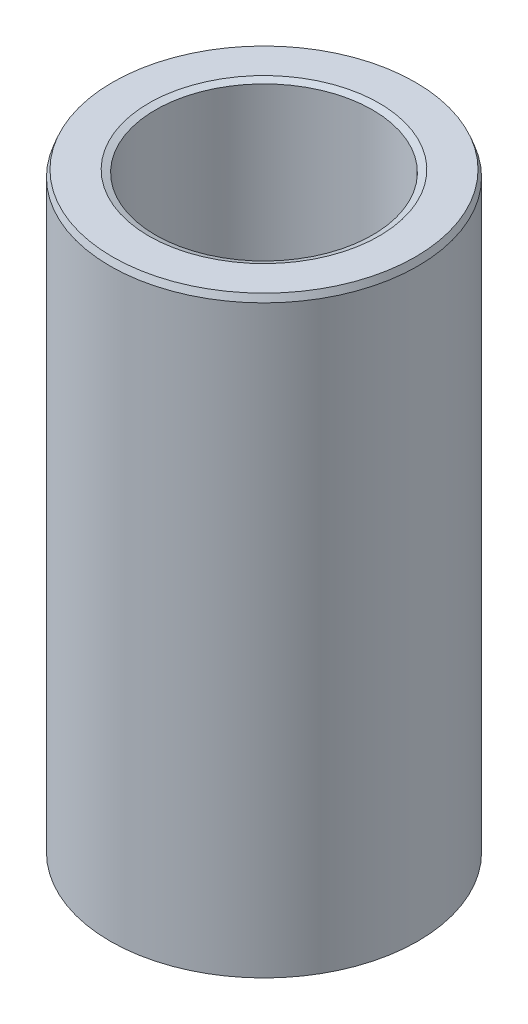
ISO-10303-21;
HEADER;
FILE_DESCRIPTION(('STEP AP214'),'2;1');
FILE_NAME('part.step','',(''),(''),'','','');
FILE_SCHEMA(('AUTOMOTIVE_DESIGN { 1 0 10303 214 1 1 1 1 }'));
ENDSEC;
DATA;
#1=APPLICATION_CONTEXT('core data for automotive mechanical design processes');
#2=APPLICATION_PROTOCOL_DEFINITION('international standard','automotive_design',2000,#1);
#3=PRODUCT_CONTEXT('',#1,'mechanical');
#4=PRODUCT('Part','Part','',(#3));
#5=PRODUCT_RELATED_PRODUCT_CATEGORY('part','',(#4));
#6=PRODUCT_DEFINITION_FORMATION('','',#4);
#7=PRODUCT_DEFINITION_CONTEXT('part definition',#1,'design');
#8=PRODUCT_DEFINITION('design','',#6,#7);
#9=PRODUCT_DEFINITION_SHAPE('','',#8);
#10=(LENGTH_UNIT() NAMED_UNIT(*) SI_UNIT(.MILLI.,.METRE.));
#11=(NAMED_UNIT(*) PLANE_ANGLE_UNIT() SI_UNIT($,.RADIAN.));
#12=(NAMED_UNIT(*) SI_UNIT($,.STERADIAN.) SOLID_ANGLE_UNIT());
#13=UNCERTAINTY_MEASURE_WITH_UNIT(LENGTH_MEASURE(1.E-05),#10,'distance_accuracy_value','');
#14=(GEOMETRIC_REPRESENTATION_CONTEXT(3) GLOBAL_UNCERTAINTY_ASSIGNED_CONTEXT((#13)) GLOBAL_UNIT_ASSIGNED_CONTEXT((#10,
#11,#12)) REPRESENTATION_CONTEXT('',''));
#15=CARTESIAN_POINT('',(0.,0.,0.));
#16=DIRECTION('',(0.,0.,1.));
#17=DIRECTION('',(1.,0.,0.));
#18=AXIS2_PLACEMENT_3D('',#15,#16,#17);
#19=CARTESIAN_POINT('',(0.,135.089937448184,0.));
#20=DIRECTION('',(0.,-1.,0.));
#21=DIRECTION('',(0.,0.,-1.));
#22=AXIS2_PLACEMENT_3D('',#19,#20,#21);
#23=CYLINDRICAL_SURFACE('',#22,35.);
#24=CARTESIAN_POINT('',(0.,0.566540213042421,0.));
#25=DIRECTION('',(0.,1.,0.));
#26=DIRECTION('',(0.,0.,1.));
#27=AXIS2_PLACEMENT_3D('',#24,#25,#26);
#28=CIRCLE('',#27,35.);
#29=CARTESIAN_POINT('',(0.,0.566540213042421,35.));
#30=VERTEX_POINT('',#29);
#31=EDGE_CURVE('E10',#30,#30,#28,.T.);
#32=ORIENTED_EDGE('',*,*,#31,.T.);
#33=EDGE_LOOP('',(#32));
#34=FACE_BOUND('',#33,.T.);
#35=CARTESIAN_POINT('',(0.,133.571248219069,0.));
#36=DIRECTION('',(0.,1.,0.));
#37=DIRECTION('',(0.,0.,1.));
#38=AXIS2_PLACEMENT_3D('',#35,#36,#37);
#39=CIRCLE('',#38,35.);
#40=CARTESIAN_POINT('',(0.,133.571248219069,35.));
#41=VERTEX_POINT('',#40);
#42=EDGE_CURVE('E50',#41,#41,#39,.F.);
#43=ORIENTED_EDGE('',*,*,#42,.T.);
#44=EDGE_LOOP('',(#43));
#45=FACE_BOUND('',#44,.T.);
#46=ADVANCED_FACE('F39',(#34,#45),#23,.T.);
#47=CARTESIAN_POINT('',(0.,135.089937448184,0.));
#48=DIRECTION('',(0.,1.,0.));
#49=DIRECTION('',(0.,0.,1.));
#50=AXIS2_PLACEMENT_3D('',#47,#48,#49);
#51=PLANE('',#50);
#52=CARTESIAN_POINT('',(0.,135.089937448184,0.));
#53=DIRECTION('',(0.,1.,0.));
#54=DIRECTION('',(0.,0.,1.));
#55=AXIS2_PLACEMENT_3D('',#52,#53,#54);
#56=CIRCLE('',#55,26.2008150151518);
#57=CARTESIAN_POINT('',(0.,135.089937448184,26.2008150151518));
#58=VERTEX_POINT('',#57);
#59=EDGE_CURVE('E58',#58,#58,#56,.F.);
#60=ORIENTED_EDGE('',*,*,#59,.T.);
#61=EDGE_LOOP('',(#60));
#62=FACE_BOUND('',#61,.T.);
#63=CARTESIAN_POINT('',(0.,135.089937448184,0.));
#64=DIRECTION('',(0.,1.,0.));
#65=DIRECTION('',(0.,0.,1.));
#66=AXIS2_PLACEMENT_3D('',#63,#64,#65);
#67=CIRCLE('',#66,34.4334597869576);
#68=CARTESIAN_POINT('',(0.,135.089937448184,34.4334597869576));
#69=VERTEX_POINT('',#68);
#70=EDGE_CURVE('E61',#69,#69,#67,.T.);
#71=ORIENTED_EDGE('',*,*,#70,.T.);
#72=EDGE_LOOP('',(#71));
#73=FACE_BOUND('',#72,.T.);
#74=ADVANCED_FACE('F88',(#62,#73),#51,.T.);
#75=CARTESIAN_POINT('',(0.,0.,0.));
#76=DIRECTION('',(0.,1.,0.));
#77=DIRECTION('',(0.,0.,1.));
#78=AXIS2_PLACEMENT_3D('',#75,#76,#77);
#79=PLANE('',#78);
#80=CARTESIAN_POINT('',(0.,0.,0.));
#81=DIRECTION('',(0.,1.,0.));
#82=DIRECTION('',(0.,0.,1.));
#83=AXIS2_PLACEMENT_3D('',#80,#81,#82);
#84=CIRCLE('',#83,25.2486659990797);
#85=CARTESIAN_POINT('',(0.,0.,-25.2486659990797));
#86=VERTEX_POINT('',#85);
#87=EDGE_CURVE('E51',#86,#86,#84,.T.);
#88=ORIENTED_EDGE('',*,*,#87,.T.);
#89=EDGE_LOOP('',(#88));
#90=FACE_BOUND('',#89,.T.);
#91=CARTESIAN_POINT('',(0.,0.,0.));
#92=DIRECTION('',(0.,1.,0.));
#93=DIRECTION('',(0.,0.,1.));
#94=AXIS2_PLACEMENT_3D('',#91,#92,#93);
#95=CIRCLE('',#94,33.4813107708854);
#96=CARTESIAN_POINT('',(0.,0.,33.4813107708854));
#97=VERTEX_POINT('',#96);
#98=EDGE_CURVE('E54',#97,#97,#95,.F.);
#99=ORIENTED_EDGE('',*,*,#98,.T.);
#100=EDGE_LOOP('',(#99));
#101=FACE_BOUND('',#100,.T.);
#102=ADVANCED_FACE('F83',(#90,#101),#79,.F.);
#103=CARTESIAN_POINT('',(0.,135.089937448184,0.));
#104=DIRECTION('',(0.,-1.,0.));
#105=DIRECTION('',(0.,0.,-1.));
#106=AXIS2_PLACEMENT_3D('',#103,#104,#105);
#107=CYLINDRICAL_SURFACE('',#106,24.6821257860373);
#108=CARTESIAN_POINT('',(0.,134.523397235142,0.));
#109=DIRECTION('',(0.,1.,0.));
#110=DIRECTION('',(0.,0.,1.));
#111=AXIS2_PLACEMENT_3D('',#108,#109,#110);
#112=CIRCLE('',#111,24.6821257860373);
#113=CARTESIAN_POINT('',(0.,134.523397235142,24.6821257860373));
#114=VERTEX_POINT('',#113);
#115=EDGE_CURVE('E67',#114,#114,#112,.T.);
#116=ORIENTED_EDGE('',*,*,#115,.T.);
#117=EDGE_LOOP('',(#116));
#118=FACE_BOUND('',#117,.T.);
#119=CARTESIAN_POINT('',(0.,1.51868922911458,0.));
#120=DIRECTION('',(0.,1.,0.));
#121=DIRECTION('',(0.,0.,1.));
#122=AXIS2_PLACEMENT_3D('',#119,#120,#121);
#123=CIRCLE('',#122,24.6821257860373);
#124=CARTESIAN_POINT('',(0.,1.51868922911458,-24.6821257860373));
#125=VERTEX_POINT('',#124);
#126=EDGE_CURVE('E69',#125,#125,#123,.F.);
#127=ORIENTED_EDGE('',*,*,#126,.T.);
#128=EDGE_LOOP('',(#127));
#129=FACE_BOUND('',#128,.T.);
#130=ADVANCED_FACE('F71',(#118,#129),#107,.F.);
#131=CARTESIAN_POINT('',(0.,134.523397235142,0.));
#132=DIRECTION('',(0.,1.,0.));
#133=DIRECTION('',(0.,0.,1.));
#134=AXIS2_PLACEMENT_3D('',#131,#132,#133);
#135=CONICAL_SURFACE('',#134,24.6821257860373,1.21374027340394);
#136=ORIENTED_EDGE('',*,*,#59,.F.);
#137=EDGE_LOOP('',(#136));
#138=FACE_BOUND('',#137,.T.);
#139=ORIENTED_EDGE('',*,*,#115,.F.);
#140=EDGE_LOOP('',(#139));
#141=FACE_BOUND('',#140,.T.);
#142=ADVANCED_FACE('F77',(#138,#141),#135,.F.);
#143=CARTESIAN_POINT('',(0.,0.,0.));
#144=DIRECTION('',(0.,-1.,0.));
#145=DIRECTION('',(0.,0.,-1.));
#146=AXIS2_PLACEMENT_3D('',#143,#144,#145);
#147=CONICAL_SURFACE('',#146,25.2486659990797,0.357056053390934);
#148=CARTESIAN_POINT('',(0.,1.51868922911458,-24.6821257860373));
#149=CARTESIAN_POINT('',(0.,1.50286954964463,-24.6880272465898));
#150=CARTESIAN_POINT('',(0.,1.48704987017469,-24.6939287071423));
#151=CARTESIAN_POINT('',(0.,1.4554105112348,-24.7057316282474));
#152=CARTESIAN_POINT('',(0.,1.43959083176486,-24.7116330887999));
#153=CARTESIAN_POINT('',(0.,1.40795147282497,-24.723436009905));
#154=CARTESIAN_POINT('',(0.,1.39213179335503,-24.7293374704575));
#155=CARTESIAN_POINT('',(0.,1.36049243441514,-24.7411403915625));
#156=CARTESIAN_POINT('',(0.,1.3446727549452,-24.7470418521151));
#157=CARTESIAN_POINT('',(0.,1.31303339600531,-24.7588447732201));
#158=CARTESIAN_POINT('',(0.,1.29721371653537,-24.7647462337726));
#159=CARTESIAN_POINT('',(0.,1.26557435759548,-24.7765491548777));
#160=CARTESIAN_POINT('',(0.,1.24975467812554,-24.7824506154302));
#161=CARTESIAN_POINT('',(0.,1.21811531918565,-24.7942535365353));
#162=CARTESIAN_POINT('',(0.,1.20229563971571,-24.8001549970878));
#163=CARTESIAN_POINT('',(0.,1.17065628077582,-24.8119579181928));
#164=CARTESIAN_POINT('',(0.,1.15483660130588,-24.8178593787454));
#165=CARTESIAN_POINT('',(0.,1.12319724236599,-24.8296622998504));
#166=CARTESIAN_POINT('',(0.,1.10737756289605,-24.8355637604029));
#167=CARTESIAN_POINT('',(0.,1.07573820395616,-24.847366681508));
#168=CARTESIAN_POINT('',(0.,1.05991852448622,-24.8532681420605));
#169=CARTESIAN_POINT('',(0.,1.02827916554633,-24.8650710631656));
#170=CARTESIAN_POINT('',(0.,1.01245948607639,-24.8709725237181));
#171=CARTESIAN_POINT('',(0.,0.980820127136498,-24.8827754448231));
#172=CARTESIAN_POINT('',(0.,0.965000447666555,-24.8886769053757));
#173=CARTESIAN_POINT('',(0.,0.933361088726668,-24.9004798264807));
#174=CARTESIAN_POINT('',(0.,0.917541409256724,-24.9063812870332));
#175=CARTESIAN_POINT('',(0.,0.885902050316837,-24.9181842081383));
#176=CARTESIAN_POINT('',(0.,0.870082370846894,-24.9240856686908));
#177=CARTESIAN_POINT('',(0.,0.838443011907007,-24.9358885897959));
#178=CARTESIAN_POINT('',(0.,0.822623332437063,-24.9417900503484));
#179=CARTESIAN_POINT('',(0.,0.790983973497176,-24.9535929714534));
#180=CARTESIAN_POINT('',(0.,0.775164294027232,-24.959494432006));
#181=CARTESIAN_POINT('',(0.,0.743524935087345,-24.971297353111));
#182=CARTESIAN_POINT('',(0.,0.727705255617402,-24.9771988136635));
#183=CARTESIAN_POINT('',(0.,0.696065896677515,-24.9890017347686));
#184=CARTESIAN_POINT('',(0.,0.680246217207571,-24.9949031953211));
#185=CARTESIAN_POINT('',(0.,0.648606858267684,-25.0067061164262));
#186=CARTESIAN_POINT('',(0.,0.632787178797741,-25.0126075769787));
#187=CARTESIAN_POINT('',(0.,0.601147819857854,-25.0244104980837));
#188=CARTESIAN_POINT('',(0.,0.58532814038791,-25.0303119586363));
#189=CARTESIAN_POINT('',(0.,0.553688781448023,-25.0421148797413));
#190=CARTESIAN_POINT('',(0.,0.537869101978079,-25.0480163402938));
#191=CARTESIAN_POINT('',(0.,0.506229743038192,-25.0598192613989));
#192=CARTESIAN_POINT('',(0.,0.490410063568249,-25.0657207219514));
#193=CARTESIAN_POINT('',(0.,0.458770704628362,-25.0775236430565));
#194=CARTESIAN_POINT('',(0.,0.442951025158419,-25.083425103609));
#195=CARTESIAN_POINT('',(0.,0.411311666218531,-25.095228024714));
#196=CARTESIAN_POINT('',(0.,0.395491986748588,-25.1011294852666));
#197=CARTESIAN_POINT('',(0.,0.363852627808701,-25.1129324063716));
#198=CARTESIAN_POINT('',(0.,0.348032948338758,-25.1188338669241));
#199=CARTESIAN_POINT('',(0.,0.316393589398871,-25.1306367880292));
#200=CARTESIAN_POINT('',(0.,0.300573909928927,-25.1365382485817));
#201=CARTESIAN_POINT('',(0.,0.26893455098904,-25.1483411696868));
#202=CARTESIAN_POINT('',(0.,0.253114871519096,-25.1542426302393));
#203=CARTESIAN_POINT('',(0.,0.221475512579209,-25.1660455513443));
#204=CARTESIAN_POINT('',(0.,0.205655833109266,-25.1719470118969));
#205=CARTESIAN_POINT('',(0.,0.174016474169379,-25.1837499330019));
#206=CARTESIAN_POINT('',(0.,0.158196794699435,-25.1896513935544));
#207=CARTESIAN_POINT('',(0.,0.126557435759548,-25.2014543146595));
#208=CARTESIAN_POINT('',(0.,0.110737756289604,-25.207355775212));
#209=CARTESIAN_POINT('',(0.,0.0790983973497175,-25.2191586963171));
#210=CARTESIAN_POINT('',(0.,0.0632787178797741,-25.2250601568696));
#211=CARTESIAN_POINT('',(0.,0.0316393589398874,-25.2368630779746));
#212=CARTESIAN_POINT('',(0.,0.0158196794699441,-25.2427645385272));
#213=CARTESIAN_POINT('',(0.,0.,-25.2486659990797));
#214=B_SPLINE_CURVE_WITH_KNOTS('',3,(#148,#149,#150,#151,#152,#153,#154,#155,#156,#157,#158,
#159,#160,#161,#162,#163,#164,#165,#166,#167,#168,#169,#170,#171,#172,#173,#174,#175,#176,#177,
#178,#179,#180,#181,#182,#183,#184,#185,#186,#187,#188,#189,#190,#191,#192,#193,#194,#195,#196,
#197,#198,#199,#200,#201,#202,#203,#204,#205,#206,#207,#208,#209,#210,#211,#212,#213),
.UNSPECIFIED.,.F.,.F.,(4,2,2,2,2,2,2,2,2,2,2,2,2,2,2,2,2,2,2,2,2,2,2,2,2,2,2,2,2,2,2,2,4),(0.,
0.0506537802800819,0.101307560560165,0.151961340840247,0.202615121120329,0.253268901400412,
0.303922681680494,0.354576461960576,0.405230242240659,0.455884022520741,0.506537802800823,
0.557191583080906,0.607845363360987,0.658499143641069,0.709152923921152,0.759806704201234,
0.810460484481316,0.861114264761399,0.911768045041481,0.962421825321564,1.01307560560165,
1.06372938588173,1.11438316616181,1.16503694644189,1.21569072672197,1.26634450700206,
1.31699828728214,1.36765206756222,1.4183058478423,1.46895962812239,1.51961340840247,
1.57026718868255,1.62092096896263),.UNSPECIFIED.);
#215=EDGE_CURVE('BSEAM73',#125,#86,#214,.T.);
#216=ORIENTED_EDGE('',*,*,#126,.F.);
#217=ORIENTED_EDGE('',*,*,#87,.F.);
#218=ORIENTED_EDGE('',*,*,#215,.T.);
#219=ORIENTED_EDGE('',*,*,#215,.F.);
#220=EDGE_LOOP('',(#216,#218,#217,#219));
#221=FACE_BOUND('',#220,.T.);
#222=ADVANCED_FACE('F73',(#221),#147,.F.);
#223=CARTESIAN_POINT('',(0.,0.566540213042421,0.));
#224=DIRECTION('',(0.,1.,0.));
#225=DIRECTION('',(0.,0.,1.));
#226=AXIS2_PLACEMENT_3D('',#223,#224,#225);
#227=CONICAL_SURFACE('',#226,35.,1.21374027340395);
#228=ORIENTED_EDGE('',*,*,#98,.F.);
#229=EDGE_LOOP('',(#228));
#230=FACE_BOUND('',#229,.T.);
#231=ORIENTED_EDGE('',*,*,#31,.F.);
#232=EDGE_LOOP('',(#231));
#233=FACE_BOUND('',#232,.T.);
#234=ADVANCED_FACE('F76',(#230,#233),#227,.T.);
#235=CARTESIAN_POINT('',(0.,135.089937448184,0.));
#236=DIRECTION('',(0.,-1.,0.));
#237=DIRECTION('',(0.,0.,-1.));
#238=AXIS2_PLACEMENT_3D('',#235,#236,#237);
#239=CONICAL_SURFACE('',#238,34.4334597869576,0.357056053390941);
#240=ORIENTED_EDGE('',*,*,#42,.F.);
#241=EDGE_LOOP('',(#240));
#242=FACE_BOUND('',#241,.T.);
#243=ORIENTED_EDGE('',*,*,#70,.F.);
#244=EDGE_LOOP('',(#243));
#245=FACE_BOUND('',#244,.T.);
#246=ADVANCED_FACE('F45',(#242,#245),#239,.T.);
#247=CLOSED_SHELL('',(#46,#74,#102,#130,#142,#222,#234,#246));
#248=MANIFOLD_SOLID_BREP('B2',#247);
#249=ADVANCED_BREP_SHAPE_REPRESENTATION('',(#18,#248),#14);
#250=SHAPE_DEFINITION_REPRESENTATION(#9,#249);
ENDSEC;
END-ISO-10303-21;
